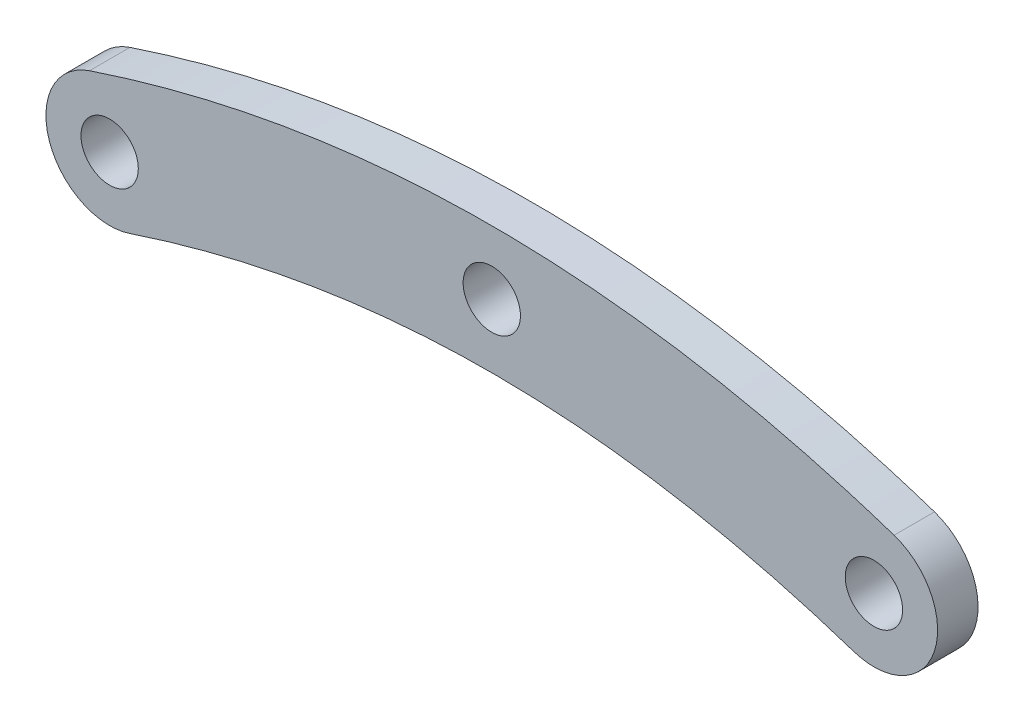
ISO-10303-21;
HEADER;
FILE_DESCRIPTION(('STEP AP214'),'2;1');
FILE_NAME('part.step','',(''),(''),'','','');
FILE_SCHEMA(('AUTOMOTIVE_DESIGN { 1 0 10303 214 1 1 1 1 }'));
ENDSEC;
DATA;
#1=APPLICATION_CONTEXT('core data for automotive mechanical design processes');
#2=APPLICATION_PROTOCOL_DEFINITION('international standard','automotive_design',2000,#1);
#3=PRODUCT_CONTEXT('',#1,'mechanical');
#4=PRODUCT('Part','Part','',(#3));
#5=PRODUCT_RELATED_PRODUCT_CATEGORY('part','',(#4));
#6=PRODUCT_DEFINITION_FORMATION('','',#4);
#7=PRODUCT_DEFINITION_CONTEXT('part definition',#1,'design');
#8=PRODUCT_DEFINITION('design','',#6,#7);
#9=PRODUCT_DEFINITION_SHAPE('','',#8);
#10=(LENGTH_UNIT() NAMED_UNIT(*) SI_UNIT(.MILLI.,.METRE.));
#11=(NAMED_UNIT(*) PLANE_ANGLE_UNIT() SI_UNIT($,.RADIAN.));
#12=(NAMED_UNIT(*) SI_UNIT($,.STERADIAN.) SOLID_ANGLE_UNIT());
#13=UNCERTAINTY_MEASURE_WITH_UNIT(LENGTH_MEASURE(1.E-05),#10,'distance_accuracy_value','');
#14=(GEOMETRIC_REPRESENTATION_CONTEXT(3) GLOBAL_UNCERTAINTY_ASSIGNED_CONTEXT((#13)) GLOBAL_UNIT_ASSIGNED_CONTEXT((#10,
#11,#12)) REPRESENTATION_CONTEXT('',''));
#15=CARTESIAN_POINT('',(0.,0.,0.));
#16=DIRECTION('',(0.,0.,1.));
#17=DIRECTION('',(1.,0.,0.));
#18=AXIS2_PLACEMENT_3D('',#15,#16,#17);
#19=CARTESIAN_POINT('',(-31.5811388300842,-0.25658350974743,1.5875));
#20=CARTESIAN_POINT('',(-19.7887170711887,3.67886201643878,1.5875));
#21=CARTESIAN_POINT('',(0.,5.3302844958903,1.5875));
#22=CARTESIAN_POINT('',(19.7887170711887,3.67886201643878,1.5875));
#23=CARTESIAN_POINT('',(31.5811388300842,-0.25658350974743,1.5875));
#24=B_SPLINE_CURVE_WITH_KNOTS('',2,(#19,#20,#21,#22,#23),.UNSPECIFIED.,.F.,.F.,(3,1,1,3),(0.,
0.375,0.625,1.),.UNSPECIFIED.);
#25=DIRECTION('',(0.,0.,-1.));
#26=VECTOR('',#25,1.);
#27=SURFACE_OF_LINEAR_EXTRUSION('',#24,#26);
#28=CARTESIAN_POINT('',(-31.5811388300842,-0.25658350974743,-1.5875));
#29=CARTESIAN_POINT('',(-19.7887170711887,3.67886201643878,-1.5875));
#30=CARTESIAN_POINT('',(0.,5.3302844958903,-1.5875));
#31=CARTESIAN_POINT('',(19.7887170711887,3.67886201643878,-1.5875));
#32=CARTESIAN_POINT('',(31.5811388300842,-0.25658350974743,-1.5875));
#33=B_SPLINE_CURVE_WITH_KNOTS('',2,(#28,#29,#30,#31,#32),.UNSPECIFIED.,.F.,.F.,(3,1,1,3),(0.,
0.375,0.625,1.),.UNSPECIFIED.);
#34=CARTESIAN_POINT('',(-31.5811388300842,-0.256583509747433,-1.5875));
#35=VERTEX_POINT('',#34);
#36=CARTESIAN_POINT('',(31.5811388300842,-0.256583509747432,-1.5875));
#37=VERTEX_POINT('',#36);
#38=EDGE_CURVE('E136',#35,#37,#33,.T.);
#39=ORIENTED_EDGE('',*,*,#38,.F.);
#40=DIRECTION('',(0.,0.,-1.));
#41=VECTOR('',#40,1.);
#42=CARTESIAN_POINT('',(-31.5811388300842,-0.256583509747433,1.5875));
#43=LINE('',#42,#41);
#44=CARTESIAN_POINT('',(-31.5811388300842,-0.256583509747433,1.5875));
#45=VERTEX_POINT('',#44);
#46=EDGE_CURVE('E11',#45,#35,#43,.T.);
#47=ORIENTED_EDGE('',*,*,#46,.F.);
#48=CARTESIAN_POINT('',(31.5811388300842,-0.256583509747432,1.5875));
#49=VERTEX_POINT('',#48);
#50=EDGE_CURVE('E107',#45,#49,#24,.T.);
#51=ORIENTED_EDGE('',*,*,#50,.T.);
#52=DIRECTION('',(0.,0.,-1.));
#53=VECTOR('',#52,1.);
#54=CARTESIAN_POINT('',(31.5811388300842,-0.256583509747432,1.5875));
#55=LINE('',#54,#53);
#56=EDGE_CURVE('E86',#49,#37,#55,.T.);
#57=ORIENTED_EDGE('',*,*,#56,.T.);
#58=EDGE_LOOP('',(#39,#47,#51,#57));
#59=FACE_BOUND('',#58,.T.);
#60=ADVANCED_FACE('F46',(#59),#27,.T.);
#61=CARTESIAN_POINT('',(-30.,-5.,1.5875));
#62=DIRECTION('',(0.,0.,-1.));
#63=DIRECTION('',(-1.,0.,0.));
#64=AXIS2_PLACEMENT_3D('',#61,#62,#63);
#65=CYLINDRICAL_SURFACE('',#64,5.);
#66=CARTESIAN_POINT('',(-30.,-5.,-1.5875));
#67=DIRECTION('',(0.,0.,1.));
#68=DIRECTION('',(1.,0.,0.));
#69=AXIS2_PLACEMENT_3D('',#66,#67,#68);
#70=CIRCLE('',#69,5.);
#71=CARTESIAN_POINT('',(-28.4188611699158,-9.74341649025257,-1.5875));
#72=VERTEX_POINT('',#71);
#73=EDGE_CURVE('E99',#72,#35,#70,.F.);
#74=ORIENTED_EDGE('',*,*,#73,.F.);
#75=DIRECTION('',(0.,0.,-1.));
#76=VECTOR('',#75,1.);
#77=CARTESIAN_POINT('',(-28.4188611699158,-9.74341649025257,1.5875));
#78=LINE('',#77,#76);
#79=CARTESIAN_POINT('',(-28.4188611699158,-9.74341649025257,1.5875));
#80=VERTEX_POINT('',#79);
#81=EDGE_CURVE('E56',#80,#72,#78,.T.);
#82=ORIENTED_EDGE('',*,*,#81,.F.);
#83=CARTESIAN_POINT('',(-30.,-5.,1.5875));
#84=DIRECTION('',(0.,0.,1.));
#85=DIRECTION('',(1.,0.,0.));
#86=AXIS2_PLACEMENT_3D('',#83,#84,#85);
#87=CIRCLE('',#86,5.);
#88=EDGE_CURVE('E97',#80,#45,#87,.F.);
#89=ORIENTED_EDGE('',*,*,#88,.T.);
#90=ORIENTED_EDGE('',*,*,#46,.T.);
#91=EDGE_LOOP('',(#74,#82,#89,#90));
#92=FACE_BOUND('',#91,.T.);
#93=ADVANCED_FACE('F95',(#92),#65,.T.);
#94=CARTESIAN_POINT('',(-28.4188611699158,-9.74341649025257,1.5875));
#95=CARTESIAN_POINT('',(-17.7112829288113,-6.17886201643878,1.5875));
#96=CARTESIAN_POINT('',(0.,-4.70528449589031,1.5875));
#97=CARTESIAN_POINT('',(17.7112829288113,-6.17886201643878,1.5875));
#98=CARTESIAN_POINT('',(28.4188611699158,-9.74341649025257,1.5875));
#99=B_SPLINE_CURVE_WITH_KNOTS('',2,(#94,#95,#96,#97,#98),.UNSPECIFIED.,.F.,.F.,(3,1,1,3),(0.,
0.375,0.625,1.),.UNSPECIFIED.);
#100=DIRECTION('',(0.,0.,-1.));
#101=VECTOR('',#100,1.);
#102=SURFACE_OF_LINEAR_EXTRUSION('',#99,#101);
#103=CARTESIAN_POINT('',(-28.4188611699158,-9.74341649025257,-1.5875));
#104=CARTESIAN_POINT('',(-17.7112829288113,-6.17886201643878,-1.5875));
#105=CARTESIAN_POINT('',(0.,-4.70528449589031,-1.5875));
#106=CARTESIAN_POINT('',(17.7112829288113,-6.17886201643878,-1.5875));
#107=CARTESIAN_POINT('',(28.4188611699158,-9.74341649025257,-1.5875));
#108=B_SPLINE_CURVE_WITH_KNOTS('',2,(#103,#104,#105,#106,#107),.UNSPECIFIED.,.F.,.F.,(3,1,1,3),
(0.,0.375,0.625,1.),.UNSPECIFIED.);
#109=CARTESIAN_POINT('',(28.4188611699158,-9.74341649025257,-1.5875));
#110=VERTEX_POINT('',#109);
#111=EDGE_CURVE('E79',#72,#110,#108,.T.);
#112=ORIENTED_EDGE('',*,*,#111,.T.);
#113=DIRECTION('',(0.,0.,-1.));
#114=VECTOR('',#113,1.);
#115=CARTESIAN_POINT('',(28.4188611699158,-9.74341649025257,1.5875));
#116=LINE('',#115,#114);
#117=CARTESIAN_POINT('',(28.4188611699158,-9.74341649025257,1.5875));
#118=VERTEX_POINT('',#117);
#119=EDGE_CURVE('E101',#118,#110,#116,.T.);
#120=ORIENTED_EDGE('',*,*,#119,.F.);
#121=EDGE_CURVE('E102',#80,#118,#99,.T.);
#122=ORIENTED_EDGE('',*,*,#121,.F.);
#123=ORIENTED_EDGE('',*,*,#81,.T.);
#124=EDGE_LOOP('',(#112,#120,#122,#123));
#125=FACE_BOUND('',#124,.T.);
#126=ADVANCED_FACE('F103',(#125),#102,.F.);
#127=CARTESIAN_POINT('',(30.,-5.,1.5875));
#128=DIRECTION('',(0.,0.,-1.));
#129=DIRECTION('',(-1.,0.,0.));
#130=AXIS2_PLACEMENT_3D('',#127,#128,#129);
#131=CYLINDRICAL_SURFACE('',#130,5.);
#132=CARTESIAN_POINT('',(30.,-5.,-1.5875));
#133=DIRECTION('',(0.,0.,1.));
#134=DIRECTION('',(1.,0.,0.));
#135=AXIS2_PLACEMENT_3D('',#132,#133,#134);
#136=CIRCLE('',#135,5.);
#137=EDGE_CURVE('E111',#110,#37,#136,.T.);
#138=ORIENTED_EDGE('',*,*,#137,.T.);
#139=ORIENTED_EDGE('',*,*,#56,.F.);
#140=CARTESIAN_POINT('',(30.,-5.,1.5875));
#141=DIRECTION('',(0.,0.,1.));
#142=DIRECTION('',(1.,0.,0.));
#143=AXIS2_PLACEMENT_3D('',#140,#141,#142);
#144=CIRCLE('',#143,5.);
#145=EDGE_CURVE('E64',#118,#49,#144,.T.);
#146=ORIENTED_EDGE('',*,*,#145,.F.);
#147=ORIENTED_EDGE('',*,*,#119,.T.);
#148=EDGE_LOOP('',(#138,#139,#146,#147));
#149=FACE_BOUND('',#148,.T.);
#150=ADVANCED_FACE('F127',(#149),#131,.T.);
#151=CARTESIAN_POINT('',(0.,0.,1.5875));
#152=DIRECTION('',(0.,0.,1.));
#153=DIRECTION('',(1.,0.,0.));
#154=AXIS2_PLACEMENT_3D('',#151,#152,#153);
#155=PLANE('',#154);
#156=CARTESIAN_POINT('',(-30.,-5.,1.5875));
#157=DIRECTION('',(0.,0.,1.));
#158=DIRECTION('',(1.,0.,0.));
#159=AXIS2_PLACEMENT_3D('',#156,#157,#158);
#160=CIRCLE('',#159,2.24999999999999);
#161=CARTESIAN_POINT('',(-27.75,-5.,1.5875));
#162=VERTEX_POINT('',#161);
#163=EDGE_CURVE('E192',#162,#162,#160,.T.);
#164=ORIENTED_EDGE('',*,*,#163,.F.);
#165=EDGE_LOOP('',(#164));
#166=FACE_BOUND('',#165,.T.);
#167=CARTESIAN_POINT('',(30.,-5.,1.5875));
#168=DIRECTION('',(0.,0.,1.));
#169=DIRECTION('',(1.,0.,0.));
#170=AXIS2_PLACEMENT_3D('',#167,#168,#169);
#171=CIRCLE('',#170,2.24999999999999);
#172=CARTESIAN_POINT('',(32.25,-5.,1.5875));
#173=VERTEX_POINT('',#172);
#174=EDGE_CURVE('E196',#173,#173,#171,.T.);
#175=ORIENTED_EDGE('',*,*,#174,.F.);
#176=EDGE_LOOP('',(#175));
#177=FACE_BOUND('',#176,.T.);
#178=CARTESIAN_POINT('',(0.,0.,1.5875));
#179=DIRECTION('',(0.,0.,1.));
#180=DIRECTION('',(1.,0.,0.));
#181=AXIS2_PLACEMENT_3D('',#178,#179,#180);
#182=CIRCLE('',#181,2.24999999999999);
#183=CARTESIAN_POINT('',(2.24999999999999,0.,1.5875));
#184=VERTEX_POINT('',#183);
#185=EDGE_CURVE('E206',#184,#184,#182,.T.);
#186=ORIENTED_EDGE('',*,*,#185,.F.);
#187=EDGE_LOOP('',(#186));
#188=FACE_BOUND('',#187,.T.);
#189=ORIENTED_EDGE('',*,*,#50,.F.);
#190=ORIENTED_EDGE('',*,*,#88,.F.);
#191=ORIENTED_EDGE('',*,*,#121,.T.);
#192=ORIENTED_EDGE('',*,*,#145,.T.);
#193=EDGE_LOOP('',(#189,#190,#191,#192));
#194=FACE_BOUND('',#193,.T.);
#195=ADVANCED_FACE('F106',(#166,#177,#188,#194),#155,.T.);
#196=CARTESIAN_POINT('',(0.,0.,-1.5875));
#197=DIRECTION('',(0.,0.,1.));
#198=DIRECTION('',(1.,0.,0.));
#199=AXIS2_PLACEMENT_3D('',#196,#197,#198);
#200=PLANE('',#199);
#201=CARTESIAN_POINT('',(-30.,-5.,-1.5875));
#202=DIRECTION('',(0.,0.,1.));
#203=DIRECTION('',(1.,0.,0.));
#204=AXIS2_PLACEMENT_3D('',#201,#202,#203);
#205=CIRCLE('',#204,2.25);
#206=CARTESIAN_POINT('',(-27.75,-5.,-1.5875));
#207=VERTEX_POINT('',#206);
#208=EDGE_CURVE('E190',#207,#207,#205,.T.);
#209=ORIENTED_EDGE('',*,*,#208,.T.);
#210=EDGE_LOOP('',(#209));
#211=FACE_BOUND('',#210,.T.);
#212=CARTESIAN_POINT('',(30.,-5.,-1.5875));
#213=DIRECTION('',(0.,0.,1.));
#214=DIRECTION('',(1.,0.,0.));
#215=AXIS2_PLACEMENT_3D('',#212,#213,#214);
#216=CIRCLE('',#215,2.25);
#217=CARTESIAN_POINT('',(32.25,-5.,-1.5875));
#218=VERTEX_POINT('',#217);
#219=EDGE_CURVE('E202',#218,#218,#216,.T.);
#220=ORIENTED_EDGE('',*,*,#219,.T.);
#221=EDGE_LOOP('',(#220));
#222=FACE_BOUND('',#221,.T.);
#223=CARTESIAN_POINT('',(0.,0.,-1.5875));
#224=DIRECTION('',(0.,0.,1.));
#225=DIRECTION('',(1.,0.,0.));
#226=AXIS2_PLACEMENT_3D('',#223,#224,#225);
#227=CIRCLE('',#226,2.25);
#228=CARTESIAN_POINT('',(2.25,0.,-1.5875));
#229=VERTEX_POINT('',#228);
#230=EDGE_CURVE('E140',#229,#229,#227,.T.);
#231=ORIENTED_EDGE('',*,*,#230,.T.);
#232=EDGE_LOOP('',(#231));
#233=FACE_BOUND('',#232,.T.);
#234=ORIENTED_EDGE('',*,*,#38,.T.);
#235=ORIENTED_EDGE('',*,*,#137,.F.);
#236=ORIENTED_EDGE('',*,*,#111,.F.);
#237=ORIENTED_EDGE('',*,*,#73,.T.);
#238=EDGE_LOOP('',(#234,#235,#236,#237));
#239=FACE_BOUND('',#238,.T.);
#240=ADVANCED_FACE('F141',(#211,#222,#233,#239),#200,.F.);
#241=CARTESIAN_POINT('',(0.,0.,1.5875));
#242=DIRECTION('',(0.,0.,1.));
#243=DIRECTION('',(1.,0.,0.));
#244=AXIS2_PLACEMENT_3D('',#241,#242,#243);
#245=CYLINDRICAL_SURFACE('',#244,2.24999999999999);
#246=ORIENTED_EDGE('',*,*,#230,.F.);
#247=EDGE_LOOP('',(#246));
#248=FACE_BOUND('',#247,.T.);
#249=ORIENTED_EDGE('',*,*,#185,.T.);
#250=EDGE_LOOP('',(#249));
#251=FACE_BOUND('',#250,.T.);
#252=ADVANCED_FACE('F170',(#248,#251),#245,.F.);
#253=CARTESIAN_POINT('',(30.,-5.,1.5875));
#254=DIRECTION('',(0.,0.,1.));
#255=DIRECTION('',(1.,0.,0.));
#256=AXIS2_PLACEMENT_3D('',#253,#254,#255);
#257=CYLINDRICAL_SURFACE('',#256,2.25);
#258=ORIENTED_EDGE('',*,*,#219,.F.);
#259=EDGE_LOOP('',(#258));
#260=FACE_BOUND('',#259,.T.);
#261=ORIENTED_EDGE('',*,*,#174,.T.);
#262=EDGE_LOOP('',(#261));
#263=FACE_BOUND('',#262,.T.);
#264=ADVANCED_FACE('F177',(#260,#263),#257,.F.);
#265=CARTESIAN_POINT('',(-30.,-5.,1.5875));
#266=DIRECTION('',(0.,0.,1.));
#267=DIRECTION('',(1.,0.,0.));
#268=AXIS2_PLACEMENT_3D('',#265,#266,#267);
#269=CYLINDRICAL_SURFACE('',#268,2.24999999999999);
#270=ORIENTED_EDGE('',*,*,#208,.F.);
#271=EDGE_LOOP('',(#270));
#272=FACE_BOUND('',#271,.T.);
#273=ORIENTED_EDGE('',*,*,#163,.T.);
#274=EDGE_LOOP('',(#273));
#275=FACE_BOUND('',#274,.T.);
#276=ADVANCED_FACE('F181',(#272,#275),#269,.F.);
#277=CLOSED_SHELL('',(#60,#93,#126,#150,#195,#240,#252,#264,#276));
#278=MANIFOLD_SOLID_BREP('B2',#277);
#279=ADVANCED_BREP_SHAPE_REPRESENTATION('',(#18,#278),#14);
#280=SHAPE_DEFINITION_REPRESENTATION(#9,#279);
ENDSEC;
END-ISO-10303-21;
